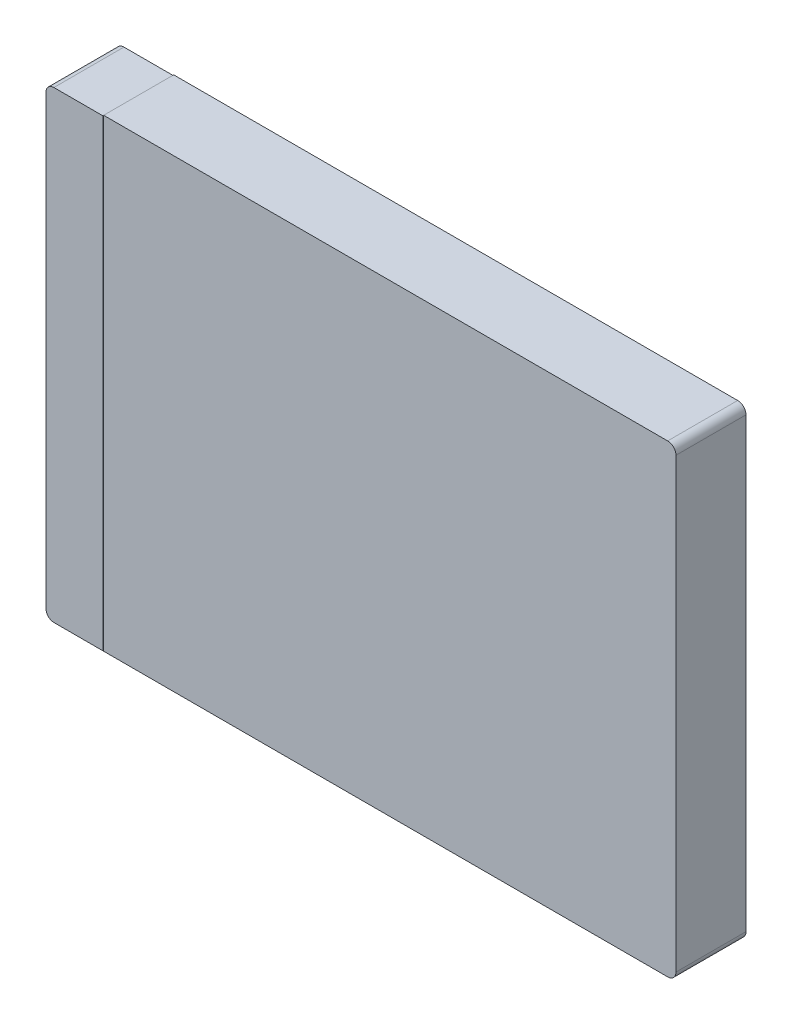
ISO-10303-21;
HEADER;
FILE_DESCRIPTION(('STEP AP214'),'2;1');
FILE_NAME('part.step','',(''),(''),'','','');
FILE_SCHEMA(('AUTOMOTIVE_DESIGN { 1 0 10303 214 1 1 1 1 }'));
ENDSEC;
DATA;
#1=APPLICATION_CONTEXT('core data for automotive mechanical design processes');
#2=APPLICATION_PROTOCOL_DEFINITION('international standard','automotive_design',2000,#1);
#3=PRODUCT_CONTEXT('',#1,'mechanical');
#4=PRODUCT('Part','Part','',(#3));
#5=PRODUCT_RELATED_PRODUCT_CATEGORY('part','',(#4));
#6=PRODUCT_DEFINITION_FORMATION('','',#4);
#7=PRODUCT_DEFINITION_CONTEXT('part definition',#1,'design');
#8=PRODUCT_DEFINITION('design','',#6,#7);
#9=PRODUCT_DEFINITION_SHAPE('','',#8);
#10=(LENGTH_UNIT() NAMED_UNIT(*) SI_UNIT(.MILLI.,.METRE.));
#11=(NAMED_UNIT(*) PLANE_ANGLE_UNIT() SI_UNIT($,.RADIAN.));
#12=(NAMED_UNIT(*) SI_UNIT($,.STERADIAN.) SOLID_ANGLE_UNIT());
#13=UNCERTAINTY_MEASURE_WITH_UNIT(LENGTH_MEASURE(1.E-05),#10,'distance_accuracy_value','');
#14=(GEOMETRIC_REPRESENTATION_CONTEXT(3) GLOBAL_UNCERTAINTY_ASSIGNED_CONTEXT((#13)) GLOBAL_UNIT_ASSIGNED_CONTEXT((#10,
#11,#12)) REPRESENTATION_CONTEXT('',''));
#15=CARTESIAN_POINT('',(0.,0.,0.));
#16=DIRECTION('',(0.,0.,1.));
#17=DIRECTION('',(1.,0.,0.));
#18=AXIS2_PLACEMENT_3D('',#15,#16,#17);
#19=CARTESIAN_POINT('',(-31.0410143754258,-28.6628721450504,4.318));
#20=DIRECTION('',(0.,1.,0.));
#21=DIRECTION('',(0.,0.,1.));
#22=AXIS2_PLACEMENT_3D('',#19,#20,#21);
#23=PLANE('',#22);
#24=DIRECTION('',(1.,0.,0.));
#25=VECTOR('',#24,1.);
#26=CARTESIAN_POINT('',(-31.0410143754258,-28.6628721450504,4.2926));
#27=LINE('',#26,#25);
#28=CARTESIAN_POINT('',(-27.508194831583,-28.6628721450504,4.2926));
#29=VERTEX_POINT('',#28);
#30=CARTESIAN_POINT('',(7.05898562457424,-28.6628721450504,4.2926));
#31=VERTEX_POINT('',#30);
#32=EDGE_CURVE('E237',#29,#31,#27,.T.);
#33=ORIENTED_EDGE('',*,*,#32,.F.);
#34=DIRECTION('',(0.,0.,-1.));
#35=VECTOR('',#34,1.);
#36=CARTESIAN_POINT('',(-27.508194831583,-28.6628721450504,4.318));
#37=LINE('',#36,#35);
#38=CARTESIAN_POINT('',(-27.508194831583,-28.6628721450504,0.));
#39=VERTEX_POINT('',#38);
#40=EDGE_CURVE('E171',#29,#39,#37,.T.);
#41=ORIENTED_EDGE('',*,*,#40,.T.);
#42=DIRECTION('',(1.,0.,0.));
#43=VECTOR('',#42,1.);
#44=CARTESIAN_POINT('',(-31.0410143754258,-28.6628721450504,0.));
#45=LINE('',#44,#43);
#46=CARTESIAN_POINT('',(7.05898562457424,-28.6628721450504,0.));
#47=VERTEX_POINT('',#46);
#48=EDGE_CURVE('E57',#39,#47,#45,.T.);
#49=ORIENTED_EDGE('',*,*,#48,.T.);
#50=DIRECTION('',(0.,0.,-1.));
#51=VECTOR('',#50,1.);
#52=CARTESIAN_POINT('',(7.05898562457424,-28.6628721450504,4.318));
#53=LINE('',#52,#51);
#54=EDGE_CURVE('E11',#47,#31,#53,.F.);
#55=ORIENTED_EDGE('',*,*,#54,.T.);
#56=EDGE_LOOP('',(#33,#41,#49,#55));
#57=FACE_BOUND('',#56,.T.);
#58=ADVANCED_FACE('F35',(#57),#23,.F.);
#59=CARTESIAN_POINT('',(7.56698562457424,-0.214872145050393,4.318));
#60=DIRECTION('',(-1.,0.,0.));
#61=DIRECTION('',(0.,-1.,0.));
#62=AXIS2_PLACEMENT_3D('',#59,#60,#61);
#63=PLANE('',#62);
#64=DIRECTION('',(0.,1.,0.));
#65=VECTOR('',#64,1.);
#66=CARTESIAN_POINT('',(7.56698562457424,-0.214872145050393,4.2926));
#67=LINE('',#66,#65);
#68=CARTESIAN_POINT('',(7.56698562457424,-28.1548721450504,4.2926));
#69=VERTEX_POINT('',#68);
#70=CARTESIAN_POINT('',(7.56698562457424,-0.722872145050393,4.2926));
#71=VERTEX_POINT('',#70);
#72=EDGE_CURVE('E227',#69,#71,#67,.T.);
#73=ORIENTED_EDGE('',*,*,#72,.F.);
#74=DIRECTION('',(0.,0.,-1.));
#75=VECTOR('',#74,1.);
#76=CARTESIAN_POINT('',(7.56698562457424,-28.1548721450504,4.318));
#77=LINE('',#76,#75);
#78=CARTESIAN_POINT('',(7.56698562457424,-28.1548721450504,0.));
#79=VERTEX_POINT('',#78);
#80=EDGE_CURVE('E221',#69,#79,#77,.T.);
#81=ORIENTED_EDGE('',*,*,#80,.T.);
#82=DIRECTION('',(0.,1.,0.));
#83=VECTOR('',#82,1.);
#84=CARTESIAN_POINT('',(7.56698562457424,-0.214872145050393,0.));
#85=LINE('',#84,#83);
#86=CARTESIAN_POINT('',(7.56698562457424,-0.722872145050393,0.));
#87=VERTEX_POINT('',#86);
#88=EDGE_CURVE('E209',#79,#87,#85,.T.);
#89=ORIENTED_EDGE('',*,*,#88,.T.);
#90=DIRECTION('',(0.,0.,-1.));
#91=VECTOR('',#90,1.);
#92=CARTESIAN_POINT('',(7.56698562457424,-0.722872145050393,4.318));
#93=LINE('',#92,#91);
#94=EDGE_CURVE('E43',#87,#71,#93,.F.);
#95=ORIENTED_EDGE('',*,*,#94,.T.);
#96=EDGE_LOOP('',(#73,#81,#89,#95));
#97=FACE_BOUND('',#96,.T.);
#98=ADVANCED_FACE('F226',(#97),#63,.F.);
#99=CARTESIAN_POINT('',(-31.0410143754258,-0.214872145050393,4.318));
#100=DIRECTION('',(0.,-1.,0.));
#101=DIRECTION('',(0.,0.,-1.));
#102=AXIS2_PLACEMENT_3D('',#99,#100,#101);
#103=PLANE('',#102);
#104=DIRECTION('',(-1.,0.,0.));
#105=VECTOR('',#104,1.);
#106=CARTESIAN_POINT('',(-31.0410143754258,-0.214872145050393,4.2926));
#107=LINE('',#106,#105);
#108=CARTESIAN_POINT('',(7.05898562457424,-0.214872145050393,4.2926));
#109=VERTEX_POINT('',#108);
#110=CARTESIAN_POINT('',(-27.508194831583,-0.214872145050393,4.2926));
#111=VERTEX_POINT('',#110);
#112=EDGE_CURVE('E157',#109,#111,#107,.T.);
#113=ORIENTED_EDGE('',*,*,#112,.F.);
#114=DIRECTION('',(0.,0.,-1.));
#115=VECTOR('',#114,1.);
#116=CARTESIAN_POINT('',(7.05898562457424,-0.214872145050393,4.318));
#117=LINE('',#116,#115);
#118=CARTESIAN_POINT('',(7.05898562457424,-0.214872145050393,0.));
#119=VERTEX_POINT('',#118);
#120=EDGE_CURVE('E215',#109,#119,#117,.T.);
#121=ORIENTED_EDGE('',*,*,#120,.T.);
#122=DIRECTION('',(-1.,0.,0.));
#123=VECTOR('',#122,1.);
#124=CARTESIAN_POINT('',(-31.0410143754258,-0.214872145050393,0.));
#125=LINE('',#124,#123);
#126=CARTESIAN_POINT('',(-27.508194831583,-0.214872145050393,0.));
#127=VERTEX_POINT('',#126);
#128=EDGE_CURVE('E212',#119,#127,#125,.T.);
#129=ORIENTED_EDGE('',*,*,#128,.T.);
#130=DIRECTION('',(0.,0.,-1.));
#131=VECTOR('',#130,1.);
#132=CARTESIAN_POINT('',(-27.508194831583,-0.214872145050393,4.318));
#133=LINE('',#132,#131);
#134=EDGE_CURVE('E170',#111,#127,#133,.T.);
#135=ORIENTED_EDGE('',*,*,#134,.F.);
#136=EDGE_LOOP('',(#113,#121,#129,#135));
#137=FACE_BOUND('',#136,.T.);
#138=ADVANCED_FACE('F280',(#137),#103,.F.);
#139=CARTESIAN_POINT('',(7.05898562457424,-0.722872145050393,4.318));
#140=DIRECTION('',(0.,0.,-1.));
#141=DIRECTION('',(-1.,0.,0.));
#142=AXIS2_PLACEMENT_3D('',#139,#140,#141);
#143=CYLINDRICAL_SURFACE('',#142,0.508);
#144=ORIENTED_EDGE('',*,*,#120,.F.);
#145=CARTESIAN_POINT('',(7.05898562457424,-0.722872145050393,4.2926));
#146=DIRECTION('',(0.,0.,1.));
#147=DIRECTION('',(1.,0.,0.));
#148=AXIS2_PLACEMENT_3D('',#145,#146,#147);
#149=CIRCLE('',#148,0.508);
#150=EDGE_CURVE('E161',#109,#71,#149,.F.);
#151=ORIENTED_EDGE('',*,*,#150,.T.);
#152=ORIENTED_EDGE('',*,*,#94,.F.);
#153=CARTESIAN_POINT('',(7.05898562457424,-0.722872145050393,0.));
#154=DIRECTION('',(0.,0.,1.));
#155=DIRECTION('',(1.,0.,0.));
#156=AXIS2_PLACEMENT_3D('',#153,#154,#155);
#157=CIRCLE('',#156,0.508);
#158=EDGE_CURVE('E219',#119,#87,#157,.F.);
#159=ORIENTED_EDGE('',*,*,#158,.F.);
#160=EDGE_LOOP('',(#144,#151,#152,#159));
#161=FACE_BOUND('',#160,.T.);
#162=ADVANCED_FACE('F234',(#161),#143,.T.);
#163=CARTESIAN_POINT('',(7.05898562457424,-28.1548721450504,4.318));
#164=DIRECTION('',(0.,0.,-1.));
#165=DIRECTION('',(-1.,0.,0.));
#166=AXIS2_PLACEMENT_3D('',#163,#164,#165);
#167=CYLINDRICAL_SURFACE('',#166,0.508);
#168=ORIENTED_EDGE('',*,*,#80,.F.);
#169=CARTESIAN_POINT('',(7.05898562457424,-28.1548721450504,4.2926));
#170=DIRECTION('',(0.,0.,1.));
#171=DIRECTION('',(1.,0.,0.));
#172=AXIS2_PLACEMENT_3D('',#169,#170,#171);
#173=CIRCLE('',#172,0.508);
#174=EDGE_CURVE('E241',#69,#31,#173,.F.);
#175=ORIENTED_EDGE('',*,*,#174,.T.);
#176=ORIENTED_EDGE('',*,*,#54,.F.);
#177=CARTESIAN_POINT('',(7.05898562457424,-28.1548721450504,0.));
#178=DIRECTION('',(0.,0.,1.));
#179=DIRECTION('',(1.,0.,0.));
#180=AXIS2_PLACEMENT_3D('',#177,#178,#179);
#181=CIRCLE('',#180,0.508);
#182=EDGE_CURVE('E217',#79,#47,#181,.F.);
#183=ORIENTED_EDGE('',*,*,#182,.F.);
#184=EDGE_LOOP('',(#168,#175,#176,#183));
#185=FACE_BOUND('',#184,.T.);
#186=ADVANCED_FACE('F37',(#185),#167,.T.);
#187=CARTESIAN_POINT('',(-27.508194831583,-12.8953741146915,0.0254));
#188=DIRECTION('',(1.,0.,0.));
#189=DIRECTION('',(0.,0.,-1.));
#190=AXIS2_PLACEMENT_3D('',#187,#188,#189);
#191=PLANE('',#190);
#192=DIRECTION('',(0.,-1.,0.));
#193=VECTOR('',#192,1.);
#194=CARTESIAN_POINT('',(-27.508194831583,6.33773014058647,4.2926));
#195=LINE('',#194,#193);
#196=CARTESIAN_POINT('',(-27.508194831583,-0.240272145050393,4.2926));
#197=VERTEX_POINT('',#196);
#198=EDGE_CURVE('E50',#111,#197,#195,.T.);
#199=ORIENTED_EDGE('',*,*,#198,.F.);
#200=ORIENTED_EDGE('',*,*,#134,.T.);
#201=DIRECTION('',(0.,-1.,0.));
#202=VECTOR('',#201,1.);
#203=CARTESIAN_POINT('',(-27.508194831583,-12.8953741146915,0.));
#204=LINE('',#203,#202);
#205=EDGE_CURVE('E173',#127,#39,#204,.T.);
#206=ORIENTED_EDGE('',*,*,#205,.T.);
#207=ORIENTED_EDGE('',*,*,#40,.F.);
#208=CARTESIAN_POINT('',(-27.508194831583,-28.6374721450504,4.2926));
#209=VERTEX_POINT('',#208);
#210=EDGE_CURVE('E151',#209,#29,#195,.T.);
#211=ORIENTED_EDGE('',*,*,#210,.F.);
#212=DIRECTION('',(0.,0.,-1.));
#213=VECTOR('',#212,1.);
#214=CARTESIAN_POINT('',(-27.508194831583,-28.6374721450504,4.318));
#215=LINE('',#214,#213);
#216=CARTESIAN_POINT('',(-27.508194831583,-28.6374721450504,0.0254000000000001));
#217=VERTEX_POINT('',#216);
#218=EDGE_CURVE('E176',#209,#217,#215,.T.);
#219=ORIENTED_EDGE('',*,*,#218,.T.);
#220=DIRECTION('',(0.,-1.,0.));
#221=VECTOR('',#220,1.);
#222=CARTESIAN_POINT('',(-27.508194831583,-12.8953741146915,0.0254));
#223=LINE('',#222,#221);
#224=CARTESIAN_POINT('',(-27.508194831583,-0.240272145050393,0.0254));
#225=VERTEX_POINT('',#224);
#226=EDGE_CURVE('E197',#225,#217,#223,.T.);
#227=ORIENTED_EDGE('',*,*,#226,.F.);
#228=DIRECTION('',(0.,0.,-1.));
#229=VECTOR('',#228,1.);
#230=CARTESIAN_POINT('',(-27.508194831583,-0.240272145050393,4.318));
#231=LINE('',#230,#229);
#232=EDGE_CURVE('E140',#197,#225,#231,.T.);
#233=ORIENTED_EDGE('',*,*,#232,.F.);
#234=EDGE_LOOP('',(#199,#200,#206,#207,#211,#219,#227,#233));
#235=FACE_BOUND('',#234,.T.);
#236=ADVANCED_FACE('F250',(#235),#191,.F.);
#237=CARTESIAN_POINT('',(-31.0410143754258,-28.6628721450504,4.318));
#238=DIRECTION('',(0.,0.,1.));
#239=DIRECTION('',(1.,0.,0.));
#240=AXIS2_PLACEMENT_3D('',#237,#238,#239);
#241=PLANE('',#240);
#242=DIRECTION('',(0.,-1.,0.));
#243=VECTOR('',#242,1.);
#244=CARTESIAN_POINT('',(-27.508194831583,6.33773014058647,4.318));
#245=LINE('',#244,#243);
#246=CARTESIAN_POINT('',(-27.508194831583,-0.240272145050393,4.318));
#247=VERTEX_POINT('',#246);
#248=CARTESIAN_POINT('',(-27.508194831583,-28.6374721450504,4.318));
#249=VERTEX_POINT('',#248);
#250=EDGE_CURVE('E133',#247,#249,#245,.T.);
#251=ORIENTED_EDGE('',*,*,#250,.F.);
#252=DIRECTION('',(-1.,0.,0.));
#253=VECTOR('',#252,1.);
#254=CARTESIAN_POINT('',(-54.6058853507296,-0.240272145050393,4.318));
#255=LINE('',#254,#253);
#256=CARTESIAN_POINT('',(-30.5330143754258,-0.240272145050393,4.318));
#257=VERTEX_POINT('',#256);
#258=EDGE_CURVE('E147',#247,#257,#255,.T.);
#259=ORIENTED_EDGE('',*,*,#258,.T.);
#260=CARTESIAN_POINT('',(-30.5330143754258,-0.722872145050393,4.318));
#261=DIRECTION('',(0.,0.,-1.));
#262=DIRECTION('',(-1.,0.,0.));
#263=AXIS2_PLACEMENT_3D('',#260,#261,#262);
#264=CIRCLE('',#263,0.482600000000002);
#265=CARTESIAN_POINT('',(-31.0156143754258,-0.722872145050395,4.318));
#266=VERTEX_POINT('',#265);
#267=EDGE_CURVE('E156',#257,#266,#264,.F.);
#268=ORIENTED_EDGE('',*,*,#267,.T.);
#269=DIRECTION('',(0.,-1.,0.));
#270=VECTOR('',#269,1.);
#271=CARTESIAN_POINT('',(-31.0156143754258,-12.8953741146915,4.318));
#272=LINE('',#271,#270);
#273=CARTESIAN_POINT('',(-31.0156143754258,-28.1548721450504,4.318));
#274=VERTEX_POINT('',#273);
#275=EDGE_CURVE('E159',#266,#274,#272,.T.);
#276=ORIENTED_EDGE('',*,*,#275,.T.);
#277=CARTESIAN_POINT('',(-30.5330143754258,-28.1548721450504,4.318));
#278=DIRECTION('',(0.,0.,-1.));
#279=DIRECTION('',(-1.,0.,0.));
#280=AXIS2_PLACEMENT_3D('',#277,#278,#279);
#281=CIRCLE('',#280,0.482600000000003);
#282=CARTESIAN_POINT('',(-30.5330143754258,-28.6374721450504,4.318));
#283=VERTEX_POINT('',#282);
#284=EDGE_CURVE('E167',#274,#283,#281,.F.);
#285=ORIENTED_EDGE('',*,*,#284,.T.);
#286=DIRECTION('',(1.,0.,0.));
#287=VECTOR('',#286,1.);
#288=CARTESIAN_POINT('',(-54.6058853507296,-28.6374721450504,4.318));
#289=LINE('',#288,#287);
#290=EDGE_CURVE('E150',#283,#249,#289,.T.);
#291=ORIENTED_EDGE('',*,*,#290,.T.);
#292=EDGE_LOOP('',(#251,#259,#268,#276,#285,#291));
#293=FACE_BOUND('',#292,.T.);
#294=ADVANCED_FACE('F145',(#293),#241,.T.);
#295=CARTESIAN_POINT('',(-31.0410143754258,-28.6628721450504,0.));
#296=DIRECTION('',(0.,0.,1.));
#297=DIRECTION('',(1.,0.,0.));
#298=AXIS2_PLACEMENT_3D('',#295,#296,#297);
#299=PLANE('',#298);
#300=ORIENTED_EDGE('',*,*,#48,.F.);
#301=ORIENTED_EDGE('',*,*,#205,.F.);
#302=ORIENTED_EDGE('',*,*,#128,.F.);
#303=ORIENTED_EDGE('',*,*,#158,.T.);
#304=ORIENTED_EDGE('',*,*,#88,.F.);
#305=ORIENTED_EDGE('',*,*,#182,.T.);
#306=EDGE_LOOP('',(#300,#301,#302,#303,#304,#305));
#307=FACE_BOUND('',#306,.T.);
#308=ADVANCED_FACE('F294',(#307),#299,.F.);
#309=CARTESIAN_POINT('',(-54.6058853507296,-12.8953741146915,0.0254));
#310=DIRECTION('',(0.,0.,-1.));
#311=DIRECTION('',(-1.,0.,0.));
#312=AXIS2_PLACEMENT_3D('',#309,#310,#311);
#313=PLANE('',#312);
#314=DIRECTION('',(0.,1.,0.));
#315=VECTOR('',#314,1.);
#316=CARTESIAN_POINT('',(-31.0156143754258,-12.8953741146915,0.0254));
#317=LINE('',#316,#315);
#318=CARTESIAN_POINT('',(-31.0156143754258,-28.1548721450504,0.0254000000000001));
#319=VERTEX_POINT('',#318);
#320=CARTESIAN_POINT('',(-31.0156143754258,-0.722872145050395,0.0254000000000001));
#321=VERTEX_POINT('',#320);
#322=EDGE_CURVE('E188',#319,#321,#317,.T.);
#323=ORIENTED_EDGE('',*,*,#322,.T.);
#324=CARTESIAN_POINT('',(-30.5330143754258,-0.722872145050393,0.0254));
#325=DIRECTION('',(0.,0.,-1.));
#326=DIRECTION('',(-1.,0.,0.));
#327=AXIS2_PLACEMENT_3D('',#324,#325,#326);
#328=CIRCLE('',#327,0.482600000000002);
#329=CARTESIAN_POINT('',(-30.5330143754258,-0.240272145050393,0.0254000000000001));
#330=VERTEX_POINT('',#329);
#331=EDGE_CURVE('E191',#321,#330,#328,.T.);
#332=ORIENTED_EDGE('',*,*,#331,.T.);
#333=DIRECTION('',(1.,0.,0.));
#334=VECTOR('',#333,1.);
#335=CARTESIAN_POINT('',(-54.6058853507296,-0.240272145050393,0.0254));
#336=LINE('',#335,#334);
#337=EDGE_CURVE('E194',#330,#225,#336,.T.);
#338=ORIENTED_EDGE('',*,*,#337,.T.);
#339=ORIENTED_EDGE('',*,*,#226,.T.);
#340=DIRECTION('',(-1.,0.,0.));
#341=VECTOR('',#340,1.);
#342=CARTESIAN_POINT('',(-54.6058853507296,-28.6374721450504,0.0254));
#343=LINE('',#342,#341);
#344=CARTESIAN_POINT('',(-30.5330143754258,-28.6374721450504,0.0254000000000001));
#345=VERTEX_POINT('',#344);
#346=EDGE_CURVE('E200',#217,#345,#343,.T.);
#347=ORIENTED_EDGE('',*,*,#346,.T.);
#348=CARTESIAN_POINT('',(-30.5330143754258,-28.1548721450504,0.0254));
#349=DIRECTION('',(0.,0.,-1.));
#350=DIRECTION('',(-1.,0.,0.));
#351=AXIS2_PLACEMENT_3D('',#348,#349,#350);
#352=CIRCLE('',#351,0.482600000000003);
#353=EDGE_CURVE('E203',#345,#319,#352,.T.);
#354=ORIENTED_EDGE('',*,*,#353,.T.);
#355=EDGE_LOOP('',(#323,#332,#338,#339,#347,#354));
#356=FACE_BOUND('',#355,.T.);
#357=ADVANCED_FACE('F256',(#356),#313,.T.);
#358=CARTESIAN_POINT('',(-54.6058853507296,-28.6374721450504,4.318));
#359=DIRECTION('',(0.,1.,0.));
#360=DIRECTION('',(-1.,0.,0.));
#361=AXIS2_PLACEMENT_3D('',#358,#359,#360);
#362=PLANE('',#361);
#363=ORIENTED_EDGE('',*,*,#346,.F.);
#364=ORIENTED_EDGE('',*,*,#218,.F.);
#365=EDGE_CURVE('E174',#249,#209,#215,.T.);
#366=ORIENTED_EDGE('',*,*,#365,.F.);
#367=ORIENTED_EDGE('',*,*,#290,.F.);
#368=DIRECTION('',(0.,0.,-1.));
#369=VECTOR('',#368,1.);
#370=CARTESIAN_POINT('',(-30.5330143754258,-28.6374721450504,4.318));
#371=LINE('',#370,#369);
#372=EDGE_CURVE('E177',#283,#345,#371,.T.);
#373=ORIENTED_EDGE('',*,*,#372,.T.);
#374=EDGE_LOOP('',(#363,#364,#366,#367,#373));
#375=FACE_BOUND('',#374,.T.);
#376=ADVANCED_FACE('F254',(#375),#362,.F.);
#377=CARTESIAN_POINT('',(-30.5330143754258,-28.1548721450504,4.318));
#378=DIRECTION('',(0.,0.,-1.));
#379=DIRECTION('',(-1.,0.,0.));
#380=AXIS2_PLACEMENT_3D('',#377,#378,#379);
#381=CYLINDRICAL_SURFACE('',#380,0.482600000000003);
#382=ORIENTED_EDGE('',*,*,#353,.F.);
#383=ORIENTED_EDGE('',*,*,#372,.F.);
#384=ORIENTED_EDGE('',*,*,#284,.F.);
#385=DIRECTION('',(0.,0.,-1.));
#386=VECTOR('',#385,1.);
#387=CARTESIAN_POINT('',(-31.0156143754258,-28.1548721450504,4.318));
#388=LINE('',#387,#386);
#389=EDGE_CURVE('E180',#274,#319,#388,.T.);
#390=ORIENTED_EDGE('',*,*,#389,.T.);
#391=EDGE_LOOP('',(#382,#383,#384,#390));
#392=FACE_BOUND('',#391,.T.);
#393=ADVANCED_FACE('F265',(#392),#381,.T.);
#394=CARTESIAN_POINT('',(-31.0156143754258,-12.8953741146915,4.318));
#395=DIRECTION('',(1.,0.,0.));
#396=DIRECTION('',(0.,1.,0.));
#397=AXIS2_PLACEMENT_3D('',#394,#395,#396);
#398=PLANE('',#397);
#399=ORIENTED_EDGE('',*,*,#322,.F.);
#400=ORIENTED_EDGE('',*,*,#389,.F.);
#401=ORIENTED_EDGE('',*,*,#275,.F.);
#402=DIRECTION('',(0.,0.,-1.));
#403=VECTOR('',#402,1.);
#404=CARTESIAN_POINT('',(-31.0156143754258,-0.722872145050395,4.318));
#405=LINE('',#404,#403);
#406=EDGE_CURVE('E183',#266,#321,#405,.T.);
#407=ORIENTED_EDGE('',*,*,#406,.T.);
#408=EDGE_LOOP('',(#399,#400,#401,#407));
#409=FACE_BOUND('',#408,.T.);
#410=ADVANCED_FACE('F261',(#409),#398,.F.);
#411=CARTESIAN_POINT('',(-30.5330143754258,-0.722872145050393,4.318));
#412=DIRECTION('',(0.,0.,-1.));
#413=DIRECTION('',(-1.,0.,0.));
#414=AXIS2_PLACEMENT_3D('',#411,#412,#413);
#415=CYLINDRICAL_SURFACE('',#414,0.482600000000002);
#416=ORIENTED_EDGE('',*,*,#331,.F.);
#417=ORIENTED_EDGE('',*,*,#406,.F.);
#418=ORIENTED_EDGE('',*,*,#267,.F.);
#419=DIRECTION('',(0.,0.,-1.));
#420=VECTOR('',#419,1.);
#421=CARTESIAN_POINT('',(-30.5330143754258,-0.240272145050393,4.318));
#422=LINE('',#421,#420);
#423=EDGE_CURVE('E139',#257,#330,#422,.T.);
#424=ORIENTED_EDGE('',*,*,#423,.T.);
#425=EDGE_LOOP('',(#416,#417,#418,#424));
#426=FACE_BOUND('',#425,.T.);
#427=ADVANCED_FACE('F259',(#426),#415,.T.);
#428=CARTESIAN_POINT('',(-54.6058853507296,-0.240272145050393,4.318));
#429=DIRECTION('',(0.,-1.,0.));
#430=DIRECTION('',(0.,0.,-1.));
#431=AXIS2_PLACEMENT_3D('',#428,#429,#430);
#432=PLANE('',#431);
#433=ORIENTED_EDGE('',*,*,#337,.F.);
#434=ORIENTED_EDGE('',*,*,#423,.F.);
#435=ORIENTED_EDGE('',*,*,#258,.F.);
#436=EDGE_CURVE('E130',#247,#197,#231,.T.);
#437=ORIENTED_EDGE('',*,*,#436,.T.);
#438=ORIENTED_EDGE('',*,*,#232,.T.);
#439=EDGE_LOOP('',(#433,#434,#435,#437,#438));
#440=FACE_BOUND('',#439,.T.);
#441=ADVANCED_FACE('F153',(#440),#432,.F.);
#442=CARTESIAN_POINT('',(-27.508194831583,-32.1284783699696,4.2926));
#443=DIRECTION('',(0.,0.,1.));
#444=DIRECTION('',(1.,0.,0.));
#445=AXIS2_PLACEMENT_3D('',#442,#443,#444);
#446=PLANE('',#445);
#447=ORIENTED_EDGE('',*,*,#112,.T.);
#448=ORIENTED_EDGE('',*,*,#198,.T.);
#449=EDGE_CURVE('E135',#197,#209,#195,.T.);
#450=ORIENTED_EDGE('',*,*,#449,.T.);
#451=ORIENTED_EDGE('',*,*,#210,.T.);
#452=ORIENTED_EDGE('',*,*,#32,.T.);
#453=ORIENTED_EDGE('',*,*,#174,.F.);
#454=ORIENTED_EDGE('',*,*,#72,.T.);
#455=ORIENTED_EDGE('',*,*,#150,.F.);
#456=EDGE_LOOP('',(#447,#448,#450,#451,#452,#453,#454,#455));
#457=FACE_BOUND('',#456,.T.);
#458=ADVANCED_FACE('F246',(#457),#446,.T.);
#459=CARTESIAN_POINT('',(-27.508194831583,6.33773014058647,4.2926));
#460=DIRECTION('',(-1.,0.,0.));
#461=DIRECTION('',(0.,0.,1.));
#462=AXIS2_PLACEMENT_3D('',#459,#460,#461);
#463=PLANE('',#462);
#464=ORIENTED_EDGE('',*,*,#449,.F.);
#465=ORIENTED_EDGE('',*,*,#436,.F.);
#466=ORIENTED_EDGE('',*,*,#250,.T.);
#467=ORIENTED_EDGE('',*,*,#365,.T.);
#468=EDGE_LOOP('',(#464,#465,#466,#467));
#469=FACE_BOUND('',#468,.T.);
#470=ADVANCED_FACE('F132',(#469),#463,.F.);
#471=CLOSED_SHELL('',(#58,#98,#138,#162,#186,#236,#294,#308,#357,#376,#393,#410,#427,#441,#458,#470));
#472=MANIFOLD_SOLID_BREP('B2',#471);
#473=ADVANCED_BREP_SHAPE_REPRESENTATION('',(#18,#472),#14);
#474=SHAPE_DEFINITION_REPRESENTATION(#9,#473);
ENDSEC;
END-ISO-10303-21;
